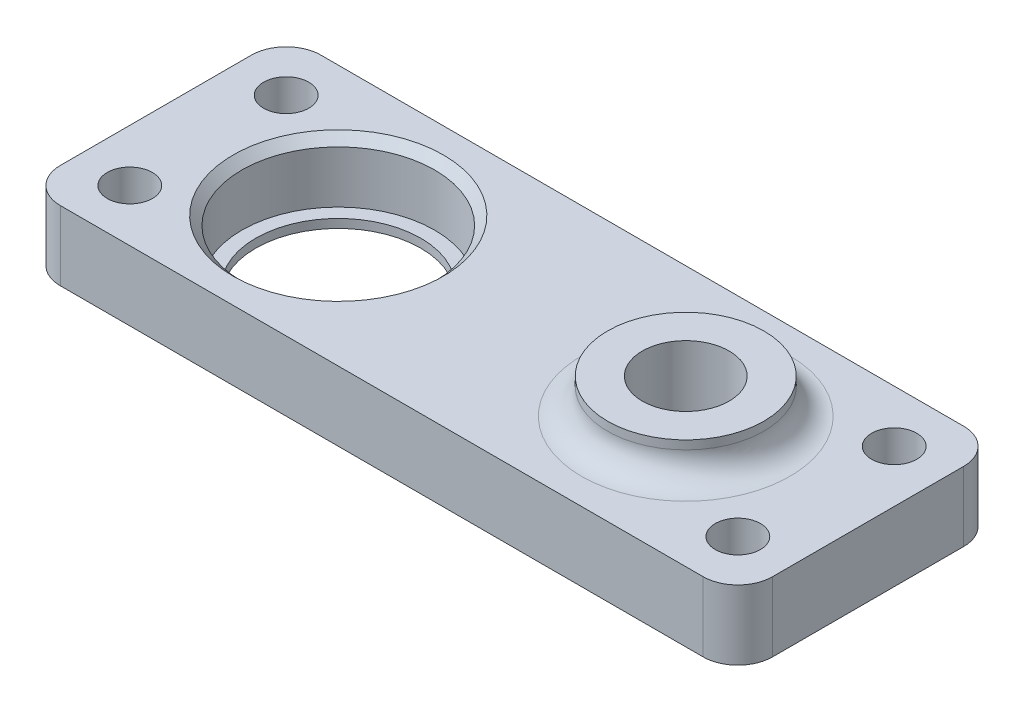
ISO-10303-21;
HEADER;
FILE_DESCRIPTION(('STEP AP214'),'2;1');
FILE_NAME('part.step','',(''),(''),'','','');
FILE_SCHEMA(('AUTOMOTIVE_DESIGN { 1 0 10303 214 1 1 1 1 }'));
ENDSEC;
DATA;
#1=APPLICATION_CONTEXT('core data for automotive mechanical design processes');
#2=APPLICATION_PROTOCOL_DEFINITION('international standard','automotive_design',2000,#1);
#3=PRODUCT_CONTEXT('',#1,'mechanical');
#4=PRODUCT('Part','Part','',(#3));
#5=PRODUCT_RELATED_PRODUCT_CATEGORY('part','',(#4));
#6=PRODUCT_DEFINITION_FORMATION('','',#4);
#7=PRODUCT_DEFINITION_CONTEXT('part definition',#1,'design');
#8=PRODUCT_DEFINITION('design','',#6,#7);
#9=PRODUCT_DEFINITION_SHAPE('','',#8);
#10=(LENGTH_UNIT() NAMED_UNIT(*) SI_UNIT(.MILLI.,.METRE.));
#11=(NAMED_UNIT(*) PLANE_ANGLE_UNIT() SI_UNIT($,.RADIAN.));
#12=(NAMED_UNIT(*) SI_UNIT($,.STERADIAN.) SOLID_ANGLE_UNIT());
#13=UNCERTAINTY_MEASURE_WITH_UNIT(LENGTH_MEASURE(1.E-05),#10,'distance_accuracy_value','');
#14=(GEOMETRIC_REPRESENTATION_CONTEXT(3) GLOBAL_UNCERTAINTY_ASSIGNED_CONTEXT((#13)) GLOBAL_UNIT_ASSIGNED_CONTEXT((#10,
#11,#12)) REPRESENTATION_CONTEXT('',''));
#15=CARTESIAN_POINT('',(0.,0.,0.));
#16=DIRECTION('',(0.,0.,1.));
#17=DIRECTION('',(1.,0.,0.));
#18=AXIS2_PLACEMENT_3D('',#15,#16,#17);
#19=CARTESIAN_POINT('',(57.,8.,-11.));
#20=DIRECTION('',(0.,-1.,0.));
#21=DIRECTION('',(0.,0.,-1.));
#22=AXIS2_PLACEMENT_3D('',#19,#20,#21);
#23=PLANE('',#22);
#24=CARTESIAN_POINT('',(0.,8.,0.));
#25=DIRECTION('',(0.,-1.,0.));
#26=DIRECTION('',(0.,0.,-1.));
#27=AXIS2_PLACEMENT_3D('',#24,#25,#26);
#28=CIRCLE('',#27,12.1);
#29=CARTESIAN_POINT('',(0.,8.,-12.1));
#30=VERTEX_POINT('',#29);
#31=EDGE_CURVE('E11',#30,#30,#28,.T.);
#32=ORIENTED_EDGE('',*,*,#31,.T.);
#33=EDGE_LOOP('',(#32));
#34=FACE_BOUND('',#33,.T.);
#35=CARTESIAN_POINT('',(40.,8.,0.));
#36=DIRECTION('',(0.,-1.,0.));
#37=DIRECTION('',(0.,0.,-1.));
#38=AXIS2_PLACEMENT_3D('',#35,#36,#37);
#39=CIRCLE('',#38,12.);
#40=CARTESIAN_POINT('',(40.,8.,-12.));
#41=VERTEX_POINT('',#40);
#42=EDGE_CURVE('E168',#41,#41,#39,.T.);
#43=ORIENTED_EDGE('',*,*,#42,.T.);
#44=EDGE_LOOP('',(#43));
#45=FACE_BOUND('',#44,.T.);
#46=CARTESIAN_POINT('',(55.,8.,9.));
#47=DIRECTION('',(0.,1.,0.));
#48=DIRECTION('',(0.,0.,1.));
#49=AXIS2_PLACEMENT_3D('',#46,#47,#48);
#50=CIRCLE('',#49,2.6);
#51=CARTESIAN_POINT('',(55.,8.,11.6));
#52=VERTEX_POINT('',#51);
#53=EDGE_CURVE('E267',#52,#52,#50,.T.);
#54=ORIENTED_EDGE('',*,*,#53,.F.);
#55=EDGE_LOOP('',(#54));
#56=FACE_BOUND('',#55,.T.);
#57=CARTESIAN_POINT('',(-15.,8.,9.));
#58=DIRECTION('',(0.,1.,0.));
#59=DIRECTION('',(0.,0.,1.));
#60=AXIS2_PLACEMENT_3D('',#57,#58,#59);
#61=CIRCLE('',#60,2.6);
#62=CARTESIAN_POINT('',(-15.,8.,11.6));
#63=VERTEX_POINT('',#62);
#64=EDGE_CURVE('E255',#63,#63,#61,.T.);
#65=ORIENTED_EDGE('',*,*,#64,.F.);
#66=EDGE_LOOP('',(#65));
#67=FACE_BOUND('',#66,.T.);
#68=CARTESIAN_POINT('',(57.,8.,-11.));
#69=DIRECTION('',(0.,1.,0.));
#70=DIRECTION('',(0.,0.,-1.));
#71=AXIS2_PLACEMENT_3D('',#68,#69,#70);
#72=CIRCLE('',#71,4.00000000000001);
#73=CARTESIAN_POINT('',(61.,8.,-11.));
#74=VERTEX_POINT('',#73);
#75=CARTESIAN_POINT('',(57.,8.,-15.));
#76=VERTEX_POINT('',#75);
#77=EDGE_CURVE('E145',#74,#76,#72,.T.);
#78=ORIENTED_EDGE('',*,*,#77,.T.);
#79=DIRECTION('',(-1.,0.,0.));
#80=VECTOR('',#79,1.);
#81=CARTESIAN_POINT('',(-17.,8.,-15.));
#82=LINE('',#81,#80);
#83=CARTESIAN_POINT('',(-17.,8.,-15.));
#84=VERTEX_POINT('',#83);
#85=EDGE_CURVE('E93',#76,#84,#82,.T.);
#86=ORIENTED_EDGE('',*,*,#85,.T.);
#87=CARTESIAN_POINT('',(-17.,8.,-11.));
#88=DIRECTION('',(0.,1.,0.));
#89=DIRECTION('',(0.,0.,1.));
#90=AXIS2_PLACEMENT_3D('',#87,#88,#89);
#91=CIRCLE('',#90,4.);
#92=CARTESIAN_POINT('',(-21.,8.,-11.));
#93=VERTEX_POINT('',#92);
#94=EDGE_CURVE('E238',#84,#93,#91,.T.);
#95=ORIENTED_EDGE('',*,*,#94,.T.);
#96=DIRECTION('',(0.,0.,1.));
#97=VECTOR('',#96,1.);
#98=CARTESIAN_POINT('',(-21.,8.,-11.));
#99=LINE('',#98,#97);
#100=CARTESIAN_POINT('',(-21.,8.,11.));
#101=VERTEX_POINT('',#100);
#102=EDGE_CURVE('E240',#93,#101,#99,.T.);
#103=ORIENTED_EDGE('',*,*,#102,.T.);
#104=CARTESIAN_POINT('',(-17.,8.,11.));
#105=DIRECTION('',(0.,1.,0.));
#106=DIRECTION('',(0.,0.,-1.));
#107=AXIS2_PLACEMENT_3D('',#104,#105,#106);
#108=CIRCLE('',#107,4.);
#109=CARTESIAN_POINT('',(-17.,8.,15.));
#110=VERTEX_POINT('',#109);
#111=EDGE_CURVE('E112',#101,#110,#108,.T.);
#112=ORIENTED_EDGE('',*,*,#111,.T.);
#113=DIRECTION('',(1.,0.,0.));
#114=VECTOR('',#113,1.);
#115=CARTESIAN_POINT('',(-17.,8.,15.));
#116=LINE('',#115,#114);
#117=CARTESIAN_POINT('',(57.,8.,15.));
#118=VERTEX_POINT('',#117);
#119=EDGE_CURVE('E106',#110,#118,#116,.T.);
#120=ORIENTED_EDGE('',*,*,#119,.T.);
#121=CARTESIAN_POINT('',(57.,8.,11.));
#122=DIRECTION('',(0.,1.,0.));
#123=DIRECTION('',(0.,0.,1.));
#124=AXIS2_PLACEMENT_3D('',#121,#122,#123);
#125=CIRCLE('',#124,4.00000000000001);
#126=CARTESIAN_POINT('',(61.,8.,11.));
#127=VERTEX_POINT('',#126);
#128=EDGE_CURVE('E110',#118,#127,#125,.T.);
#129=ORIENTED_EDGE('',*,*,#128,.T.);
#130=DIRECTION('',(0.,0.,-1.));
#131=VECTOR('',#130,1.);
#132=CARTESIAN_POINT('',(61.,8.,-11.));
#133=LINE('',#132,#131);
#134=EDGE_CURVE('E49',#127,#74,#133,.T.);
#135=ORIENTED_EDGE('',*,*,#134,.T.);
#136=EDGE_LOOP('',(#78,#86,#95,#103,#112,#120,#129,#135));
#137=FACE_BOUND('',#136,.T.);
#138=CARTESIAN_POINT('',(-15.,8.,-9.));
#139=DIRECTION('',(0.,1.,0.));
#140=DIRECTION('',(0.,0.,1.));
#141=AXIS2_PLACEMENT_3D('',#138,#139,#140);
#142=CIRCLE('',#141,2.6);
#143=CARTESIAN_POINT('',(-15.,8.,-6.4));
#144=VERTEX_POINT('',#143);
#145=EDGE_CURVE('E251',#144,#144,#142,.T.);
#146=ORIENTED_EDGE('',*,*,#145,.F.);
#147=EDGE_LOOP('',(#146));
#148=FACE_BOUND('',#147,.T.);
#149=CARTESIAN_POINT('',(55.,8.,-9.));
#150=DIRECTION('',(0.,1.,0.));
#151=DIRECTION('',(0.,0.,1.));
#152=AXIS2_PLACEMENT_3D('',#149,#150,#151);
#153=CIRCLE('',#152,2.6);
#154=CARTESIAN_POINT('',(55.,8.,-6.4));
#155=VERTEX_POINT('',#154);
#156=EDGE_CURVE('E261',#155,#155,#153,.T.);
#157=ORIENTED_EDGE('',*,*,#156,.F.);
#158=EDGE_LOOP('',(#157));
#159=FACE_BOUND('',#158,.T.);
#160=ADVANCED_FACE('F32',(#34,#45,#56,#67,#137,#148,#159),#23,.F.);
#161=CARTESIAN_POINT('',(0.,8.,0.));
#162=DIRECTION('',(0.,-1.,0.));
#163=DIRECTION('',(0.,0.,-1.));
#164=AXIS2_PLACEMENT_3D('',#161,#162,#163);
#165=CYLINDRICAL_SURFACE('',#164,9.5);
#166=CARTESIAN_POINT('',(0.,0.,0.));
#167=DIRECTION('',(0.,1.,0.));
#168=DIRECTION('',(0.,0.,1.));
#169=AXIS2_PLACEMENT_3D('',#166,#167,#168);
#170=CIRCLE('',#169,9.5);
#171=CARTESIAN_POINT('',(0.,0.,9.5));
#172=VERTEX_POINT('',#171);
#173=EDGE_CURVE('E134',#172,#172,#170,.T.);
#174=ORIENTED_EDGE('',*,*,#173,.F.);
#175=EDGE_LOOP('',(#174));
#176=FACE_BOUND('',#175,.T.);
#177=CARTESIAN_POINT('',(0.,1.,0.));
#178=DIRECTION('',(0.,1.,0.));
#179=DIRECTION('',(0.,0.,1.));
#180=AXIS2_PLACEMENT_3D('',#177,#178,#179);
#181=CIRCLE('',#180,9.5);
#182=CARTESIAN_POINT('',(0.,1.,9.5));
#183=VERTEX_POINT('',#182);
#184=EDGE_CURVE('E161',#183,#183,#181,.T.);
#185=ORIENTED_EDGE('',*,*,#184,.T.);
#186=EDGE_LOOP('',(#185));
#187=FACE_BOUND('',#186,.T.);
#188=ADVANCED_FACE('F186',(#176,#187),#165,.F.);
#189=CARTESIAN_POINT('',(57.,0.,-11.));
#190=DIRECTION('',(0.,-1.,0.));
#191=DIRECTION('',(0.,0.,-1.));
#192=AXIS2_PLACEMENT_3D('',#189,#190,#191);
#193=PLANE('',#192);
#194=CARTESIAN_POINT('',(55.,0.,-9.));
#195=DIRECTION('',(0.,1.,0.));
#196=DIRECTION('',(0.,0.,1.));
#197=AXIS2_PLACEMENT_3D('',#194,#195,#196);
#198=CIRCLE('',#197,2.6);
#199=CARTESIAN_POINT('',(55.,0.,-6.4));
#200=VERTEX_POINT('',#199);
#201=EDGE_CURVE('E264',#200,#200,#198,.T.);
#202=ORIENTED_EDGE('',*,*,#201,.T.);
#203=EDGE_LOOP('',(#202));
#204=FACE_BOUND('',#203,.T.);
#205=CARTESIAN_POINT('',(-15.,0.,-9.));
#206=DIRECTION('',(0.,1.,0.));
#207=DIRECTION('',(0.,0.,1.));
#208=AXIS2_PLACEMENT_3D('',#205,#206,#207);
#209=CIRCLE('',#208,2.6);
#210=CARTESIAN_POINT('',(-15.,0.,-6.4));
#211=VERTEX_POINT('',#210);
#212=EDGE_CURVE('E252',#211,#211,#209,.T.);
#213=ORIENTED_EDGE('',*,*,#212,.T.);
#214=EDGE_LOOP('',(#213));
#215=FACE_BOUND('',#214,.T.);
#216=ORIENTED_EDGE('',*,*,#173,.T.);
#217=EDGE_LOOP('',(#216));
#218=FACE_BOUND('',#217,.T.);
#219=CARTESIAN_POINT('',(57.,0.,-11.));
#220=DIRECTION('',(0.,1.,0.));
#221=DIRECTION('',(0.,0.,-1.));
#222=AXIS2_PLACEMENT_3D('',#219,#220,#221);
#223=CIRCLE('',#222,4.00000000000001);
#224=CARTESIAN_POINT('',(61.,0.,-11.));
#225=VERTEX_POINT('',#224);
#226=CARTESIAN_POINT('',(57.,0.,-15.));
#227=VERTEX_POINT('',#226);
#228=EDGE_CURVE('E130',#225,#227,#223,.T.);
#229=ORIENTED_EDGE('',*,*,#228,.F.);
#230=DIRECTION('',(0.,0.,-1.));
#231=VECTOR('',#230,1.);
#232=CARTESIAN_POINT('',(61.,0.,-11.));
#233=LINE('',#232,#231);
#234=CARTESIAN_POINT('',(61.,0.,11.));
#235=VERTEX_POINT('',#234);
#236=EDGE_CURVE('E84',#235,#225,#233,.T.);
#237=ORIENTED_EDGE('',*,*,#236,.F.);
#238=CARTESIAN_POINT('',(57.,0.,11.));
#239=DIRECTION('',(0.,1.,0.));
#240=DIRECTION('',(0.,0.,1.));
#241=AXIS2_PLACEMENT_3D('',#238,#239,#240);
#242=CIRCLE('',#241,4.00000000000001);
#243=CARTESIAN_POINT('',(57.,0.,15.));
#244=VERTEX_POINT('',#243);
#245=EDGE_CURVE('E78',#244,#235,#242,.T.);
#246=ORIENTED_EDGE('',*,*,#245,.F.);
#247=DIRECTION('',(1.,0.,0.));
#248=VECTOR('',#247,1.);
#249=CARTESIAN_POINT('',(-17.,0.,15.));
#250=LINE('',#249,#248);
#251=CARTESIAN_POINT('',(-17.,0.,15.));
#252=VERTEX_POINT('',#251);
#253=EDGE_CURVE('E120',#252,#244,#250,.T.);
#254=ORIENTED_EDGE('',*,*,#253,.F.);
#255=CARTESIAN_POINT('',(-17.,0.,11.));
#256=DIRECTION('',(0.,1.,0.));
#257=DIRECTION('',(0.,0.,-1.));
#258=AXIS2_PLACEMENT_3D('',#255,#256,#257);
#259=CIRCLE('',#258,4.);
#260=CARTESIAN_POINT('',(-21.,0.,11.));
#261=VERTEX_POINT('',#260);
#262=EDGE_CURVE('E140',#261,#252,#259,.T.);
#263=ORIENTED_EDGE('',*,*,#262,.F.);
#264=DIRECTION('',(0.,0.,1.));
#265=VECTOR('',#264,1.);
#266=CARTESIAN_POINT('',(-21.,0.,-11.));
#267=LINE('',#266,#265);
#268=CARTESIAN_POINT('',(-21.,0.,-11.));
#269=VERTEX_POINT('',#268);
#270=EDGE_CURVE('E138',#269,#261,#267,.T.);
#271=ORIENTED_EDGE('',*,*,#270,.F.);
#272=CARTESIAN_POINT('',(-17.,0.,-11.));
#273=DIRECTION('',(0.,1.,0.));
#274=DIRECTION('',(0.,0.,1.));
#275=AXIS2_PLACEMENT_3D('',#272,#273,#274);
#276=CIRCLE('',#275,4.);
#277=CARTESIAN_POINT('',(-17.,0.,-15.));
#278=VERTEX_POINT('',#277);
#279=EDGE_CURVE('E136',#278,#269,#276,.T.);
#280=ORIENTED_EDGE('',*,*,#279,.F.);
#281=DIRECTION('',(-1.,0.,0.));
#282=VECTOR('',#281,1.);
#283=CARTESIAN_POINT('',(-17.,0.,-15.));
#284=LINE('',#283,#282);
#285=EDGE_CURVE('E133',#227,#278,#284,.T.);
#286=ORIENTED_EDGE('',*,*,#285,.F.);
#287=EDGE_LOOP('',(#229,#237,#246,#254,#263,#271,#280,#286));
#288=FACE_BOUND('',#287,.T.);
#289=CARTESIAN_POINT('',(40.,0.,0.));
#290=DIRECTION('',(0.,1.,0.));
#291=DIRECTION('',(0.,0.,1.));
#292=AXIS2_PLACEMENT_3D('',#289,#290,#291);
#293=CIRCLE('',#292,5.);
#294=CARTESIAN_POINT('',(40.,0.,5.));
#295=VERTEX_POINT('',#294);
#296=EDGE_CURVE('E248',#295,#295,#293,.T.);
#297=ORIENTED_EDGE('',*,*,#296,.T.);
#298=EDGE_LOOP('',(#297));
#299=FACE_BOUND('',#298,.T.);
#300=CARTESIAN_POINT('',(-15.,0.,9.));
#301=DIRECTION('',(0.,1.,0.));
#302=DIRECTION('',(0.,0.,1.));
#303=AXIS2_PLACEMENT_3D('',#300,#301,#302);
#304=CIRCLE('',#303,2.6);
#305=CARTESIAN_POINT('',(-15.,0.,11.6));
#306=VERTEX_POINT('',#305);
#307=EDGE_CURVE('E258',#306,#306,#304,.T.);
#308=ORIENTED_EDGE('',*,*,#307,.T.);
#309=EDGE_LOOP('',(#308));
#310=FACE_BOUND('',#309,.T.);
#311=CARTESIAN_POINT('',(55.,0.,9.));
#312=DIRECTION('',(0.,1.,0.));
#313=DIRECTION('',(0.,0.,1.));
#314=AXIS2_PLACEMENT_3D('',#311,#312,#313);
#315=CIRCLE('',#314,2.6);
#316=CARTESIAN_POINT('',(55.,0.,11.6));
#317=VERTEX_POINT('',#316);
#318=EDGE_CURVE('E164',#317,#317,#315,.T.);
#319=ORIENTED_EDGE('',*,*,#318,.T.);
#320=EDGE_LOOP('',(#319));
#321=FACE_BOUND('',#320,.T.);
#322=ADVANCED_FACE('F192',(#204,#215,#218,#288,#299,#310,#321),#193,.T.);
#323=CARTESIAN_POINT('',(57.,8.,-11.));
#324=DIRECTION('',(0.,-1.,0.));
#325=DIRECTION('',(0.,0.,-1.));
#326=AXIS2_PLACEMENT_3D('',#323,#324,#325);
#327=CYLINDRICAL_SURFACE('',#326,4.00000000000001);
#328=ORIENTED_EDGE('',*,*,#228,.T.);
#329=DIRECTION('',(0.,-1.,0.));
#330=VECTOR('',#329,1.);
#331=CARTESIAN_POINT('',(57.,8.,-15.));
#332=LINE('',#331,#330);
#333=EDGE_CURVE('E158',#76,#227,#332,.T.);
#334=ORIENTED_EDGE('',*,*,#333,.F.);
#335=ORIENTED_EDGE('',*,*,#77,.F.);
#336=DIRECTION('',(0.,-1.,0.));
#337=VECTOR('',#336,1.);
#338=CARTESIAN_POINT('',(61.,8.,-11.));
#339=LINE('',#338,#337);
#340=EDGE_CURVE('E126',#74,#225,#339,.T.);
#341=ORIENTED_EDGE('',*,*,#340,.T.);
#342=EDGE_LOOP('',(#328,#334,#335,#341));
#343=FACE_BOUND('',#342,.T.);
#344=ADVANCED_FACE('F200',(#343),#327,.T.);
#345=CARTESIAN_POINT('',(-17.,8.,-15.));
#346=DIRECTION('',(0.,0.,1.));
#347=DIRECTION('',(1.,0.,0.));
#348=AXIS2_PLACEMENT_3D('',#345,#346,#347);
#349=PLANE('',#348);
#350=ORIENTED_EDGE('',*,*,#285,.T.);
#351=DIRECTION('',(0.,-1.,0.));
#352=VECTOR('',#351,1.);
#353=CARTESIAN_POINT('',(-17.,8.,-15.));
#354=LINE('',#353,#352);
#355=EDGE_CURVE('E155',#84,#278,#354,.T.);
#356=ORIENTED_EDGE('',*,*,#355,.F.);
#357=ORIENTED_EDGE('',*,*,#85,.F.);
#358=ORIENTED_EDGE('',*,*,#333,.T.);
#359=EDGE_LOOP('',(#350,#356,#357,#358));
#360=FACE_BOUND('',#359,.T.);
#361=ADVANCED_FACE('F221',(#360),#349,.F.);
#362=CARTESIAN_POINT('',(-17.,8.,-11.));
#363=DIRECTION('',(0.,-1.,0.));
#364=DIRECTION('',(0.,0.,-1.));
#365=AXIS2_PLACEMENT_3D('',#362,#363,#364);
#366=CYLINDRICAL_SURFACE('',#365,4.);
#367=ORIENTED_EDGE('',*,*,#279,.T.);
#368=DIRECTION('',(0.,-1.,0.));
#369=VECTOR('',#368,1.);
#370=CARTESIAN_POINT('',(-21.,8.,-11.));
#371=LINE('',#370,#369);
#372=EDGE_CURVE('E152',#93,#269,#371,.T.);
#373=ORIENTED_EDGE('',*,*,#372,.F.);
#374=ORIENTED_EDGE('',*,*,#94,.F.);
#375=ORIENTED_EDGE('',*,*,#355,.T.);
#376=EDGE_LOOP('',(#367,#373,#374,#375));
#377=FACE_BOUND('',#376,.T.);
#378=ADVANCED_FACE('F217',(#377),#366,.T.);
#379=CARTESIAN_POINT('',(-21.,8.,-11.));
#380=DIRECTION('',(1.,0.,0.));
#381=DIRECTION('',(0.,0.,-1.));
#382=AXIS2_PLACEMENT_3D('',#379,#380,#381);
#383=PLANE('',#382);
#384=ORIENTED_EDGE('',*,*,#270,.T.);
#385=DIRECTION('',(0.,-1.,0.));
#386=VECTOR('',#385,1.);
#387=CARTESIAN_POINT('',(-21.,8.,11.));
#388=LINE('',#387,#386);
#389=EDGE_CURVE('E149',#101,#261,#388,.T.);
#390=ORIENTED_EDGE('',*,*,#389,.F.);
#391=ORIENTED_EDGE('',*,*,#102,.F.);
#392=ORIENTED_EDGE('',*,*,#372,.T.);
#393=EDGE_LOOP('',(#384,#390,#391,#392));
#394=FACE_BOUND('',#393,.T.);
#395=ADVANCED_FACE('F213',(#394),#383,.F.);
#396=CARTESIAN_POINT('',(-17.,8.,11.));
#397=DIRECTION('',(0.,-1.,0.));
#398=DIRECTION('',(0.,0.,-1.));
#399=AXIS2_PLACEMENT_3D('',#396,#397,#398);
#400=CYLINDRICAL_SURFACE('',#399,4.);
#401=ORIENTED_EDGE('',*,*,#262,.T.);
#402=DIRECTION('',(0.,-1.,0.));
#403=VECTOR('',#402,1.);
#404=CARTESIAN_POINT('',(-17.,8.,15.));
#405=LINE('',#404,#403);
#406=EDGE_CURVE('E121',#110,#252,#405,.T.);
#407=ORIENTED_EDGE('',*,*,#406,.F.);
#408=ORIENTED_EDGE('',*,*,#111,.F.);
#409=ORIENTED_EDGE('',*,*,#389,.T.);
#410=EDGE_LOOP('',(#401,#407,#408,#409));
#411=FACE_BOUND('',#410,.T.);
#412=ADVANCED_FACE('F210',(#411),#400,.T.);
#413=CARTESIAN_POINT('',(-17.,8.,15.));
#414=DIRECTION('',(0.,0.,-1.));
#415=DIRECTION('',(-1.,0.,0.));
#416=AXIS2_PLACEMENT_3D('',#413,#414,#415);
#417=PLANE('',#416);
#418=ORIENTED_EDGE('',*,*,#253,.T.);
#419=DIRECTION('',(0.,-1.,0.));
#420=VECTOR('',#419,1.);
#421=CARTESIAN_POINT('',(57.,8.,15.));
#422=LINE('',#421,#420);
#423=EDGE_CURVE('E117',#118,#244,#422,.T.);
#424=ORIENTED_EDGE('',*,*,#423,.F.);
#425=ORIENTED_EDGE('',*,*,#119,.F.);
#426=ORIENTED_EDGE('',*,*,#406,.T.);
#427=EDGE_LOOP('',(#418,#424,#425,#426));
#428=FACE_BOUND('',#427,.T.);
#429=ADVANCED_FACE('F118',(#428),#417,.F.);
#430=CARTESIAN_POINT('',(57.,8.,11.));
#431=DIRECTION('',(0.,-1.,0.));
#432=DIRECTION('',(0.,0.,-1.));
#433=AXIS2_PLACEMENT_3D('',#430,#431,#432);
#434=CYLINDRICAL_SURFACE('',#433,4.00000000000001);
#435=ORIENTED_EDGE('',*,*,#245,.T.);
#436=DIRECTION('',(0.,-1.,0.));
#437=VECTOR('',#436,1.);
#438=CARTESIAN_POINT('',(61.,8.,11.));
#439=LINE('',#438,#437);
#440=EDGE_CURVE('E122',#127,#235,#439,.T.);
#441=ORIENTED_EDGE('',*,*,#440,.F.);
#442=ORIENTED_EDGE('',*,*,#128,.F.);
#443=ORIENTED_EDGE('',*,*,#423,.T.);
#444=EDGE_LOOP('',(#435,#441,#442,#443));
#445=FACE_BOUND('',#444,.T.);
#446=ADVANCED_FACE('F124',(#445),#434,.T.);
#447=CARTESIAN_POINT('',(61.,8.,-11.));
#448=DIRECTION('',(-1.,0.,0.));
#449=DIRECTION('',(0.,0.,1.));
#450=AXIS2_PLACEMENT_3D('',#447,#448,#449);
#451=PLANE('',#450);
#452=ORIENTED_EDGE('',*,*,#236,.T.);
#453=ORIENTED_EDGE('',*,*,#340,.F.);
#454=ORIENTED_EDGE('',*,*,#134,.F.);
#455=ORIENTED_EDGE('',*,*,#440,.T.);
#456=EDGE_LOOP('',(#452,#453,#454,#455));
#457=FACE_BOUND('',#456,.T.);
#458=ADVANCED_FACE('F202',(#457),#451,.F.);
#459=CARTESIAN_POINT('',(40.,8.,0.));
#460=DIRECTION('',(0.,-1.,0.));
#461=DIRECTION('',(0.,0.,-1.));
#462=AXIS2_PLACEMENT_3D('',#459,#460,#461);
#463=CYLINDRICAL_SURFACE('',#462,5.);
#464=ORIENTED_EDGE('',*,*,#296,.F.);
#465=EDGE_LOOP('',(#464));
#466=FACE_BOUND('',#465,.T.);
#467=CARTESIAN_POINT('',(40.,12.,0.));
#468=DIRECTION('',(0.,1.,0.));
#469=DIRECTION('',(0.,0.,1.));
#470=AXIS2_PLACEMENT_3D('',#467,#468,#469);
#471=CIRCLE('',#470,5.);
#472=CARTESIAN_POINT('',(40.,12.,5.));
#473=VERTEX_POINT('',#472);
#474=EDGE_CURVE('E279',#473,#473,#471,.T.);
#475=ORIENTED_EDGE('',*,*,#474,.T.);
#476=EDGE_LOOP('',(#475));
#477=FACE_BOUND('',#476,.T.);
#478=ADVANCED_FACE('F205',(#466,#477),#463,.F.);
#479=CARTESIAN_POINT('',(-15.,8.,-9.));
#480=DIRECTION('',(0.,-1.,0.));
#481=DIRECTION('',(0.,0.,-1.));
#482=AXIS2_PLACEMENT_3D('',#479,#480,#481);
#483=CYLINDRICAL_SURFACE('',#482,2.6);
#484=ORIENTED_EDGE('',*,*,#145,.T.);
#485=EDGE_LOOP('',(#484));
#486=FACE_BOUND('',#485,.T.);
#487=ORIENTED_EDGE('',*,*,#212,.F.);
#488=EDGE_LOOP('',(#487));
#489=FACE_BOUND('',#488,.T.);
#490=ADVANCED_FACE('F311',(#486,#489),#483,.F.);
#491=CARTESIAN_POINT('',(-15.,8.,9.));
#492=DIRECTION('',(0.,-1.,0.));
#493=DIRECTION('',(0.,0.,-1.));
#494=AXIS2_PLACEMENT_3D('',#491,#492,#493);
#495=CYLINDRICAL_SURFACE('',#494,2.6);
#496=ORIENTED_EDGE('',*,*,#64,.T.);
#497=EDGE_LOOP('',(#496));
#498=FACE_BOUND('',#497,.T.);
#499=ORIENTED_EDGE('',*,*,#307,.F.);
#500=EDGE_LOOP('',(#499));
#501=FACE_BOUND('',#500,.T.);
#502=ADVANCED_FACE('F307',(#498,#501),#495,.F.);
#503=CARTESIAN_POINT('',(55.,8.,-9.));
#504=DIRECTION('',(0.,-1.,0.));
#505=DIRECTION('',(0.,0.,-1.));
#506=AXIS2_PLACEMENT_3D('',#503,#504,#505);
#507=CYLINDRICAL_SURFACE('',#506,2.6);
#508=ORIENTED_EDGE('',*,*,#156,.T.);
#509=EDGE_LOOP('',(#508));
#510=FACE_BOUND('',#509,.T.);
#511=ORIENTED_EDGE('',*,*,#201,.F.);
#512=EDGE_LOOP('',(#511));
#513=FACE_BOUND('',#512,.T.);
#514=ADVANCED_FACE('F303',(#510,#513),#507,.F.);
#515=CARTESIAN_POINT('',(55.,8.,9.));
#516=DIRECTION('',(0.,-1.,0.));
#517=DIRECTION('',(0.,0.,-1.));
#518=AXIS2_PLACEMENT_3D('',#515,#516,#517);
#519=CYLINDRICAL_SURFACE('',#518,2.6);
#520=ORIENTED_EDGE('',*,*,#53,.T.);
#521=EDGE_LOOP('',(#520));
#522=FACE_BOUND('',#521,.T.);
#523=ORIENTED_EDGE('',*,*,#318,.F.);
#524=EDGE_LOOP('',(#523));
#525=FACE_BOUND('',#524,.T.);
#526=ADVANCED_FACE('F300',(#522,#525),#519,.F.);
#527=CARTESIAN_POINT('',(0.,1.,0.));
#528=DIRECTION('',(0.,1.,0.));
#529=DIRECTION('',(0.,0.,1.));
#530=AXIS2_PLACEMENT_3D('',#527,#528,#529);
#531=CYLINDRICAL_SURFACE('',#530,11.1);
#532=CARTESIAN_POINT('',(0.,6.99999999999998,0.));
#533=DIRECTION('',(0.,-1.,0.));
#534=DIRECTION('',(0.,0.,-1.));
#535=AXIS2_PLACEMENT_3D('',#532,#533,#534);
#536=CIRCLE('',#535,11.1);
#537=CARTESIAN_POINT('',(0.,6.99999999999998,-11.1));
#538=VERTEX_POINT('',#537);
#539=EDGE_CURVE('E41',#538,#538,#536,.F.);
#540=ORIENTED_EDGE('',*,*,#539,.T.);
#541=EDGE_LOOP('',(#540));
#542=FACE_BOUND('',#541,.T.);
#543=CARTESIAN_POINT('',(0.,1.,0.));
#544=DIRECTION('',(0.,1.,0.));
#545=DIRECTION('',(0.,0.,1.));
#546=AXIS2_PLACEMENT_3D('',#543,#544,#545);
#547=CIRCLE('',#546,11.1);
#548=CARTESIAN_POINT('',(0.,1.,11.1));
#549=VERTEX_POINT('',#548);
#550=EDGE_CURVE('E165',#549,#549,#547,.T.);
#551=ORIENTED_EDGE('',*,*,#550,.F.);
#552=EDGE_LOOP('',(#551));
#553=FACE_BOUND('',#552,.T.);
#554=ADVANCED_FACE('F173',(#542,#553),#531,.F.);
#555=CARTESIAN_POINT('',(0.,1.,0.));
#556=DIRECTION('',(0.,1.,0.));
#557=DIRECTION('',(0.,0.,1.));
#558=AXIS2_PLACEMENT_3D('',#555,#556,#557);
#559=PLANE('',#558);
#560=ORIENTED_EDGE('',*,*,#184,.F.);
#561=EDGE_LOOP('',(#560));
#562=FACE_BOUND('',#561,.T.);
#563=ORIENTED_EDGE('',*,*,#550,.T.);
#564=EDGE_LOOP('',(#563));
#565=FACE_BOUND('',#564,.T.);
#566=ADVANCED_FACE('F286',(#562,#565),#559,.T.);
#567=CARTESIAN_POINT('',(40.,12.,0.));
#568=DIRECTION('',(0.,1.,0.));
#569=DIRECTION('',(0.,0.,1.));
#570=AXIS2_PLACEMENT_3D('',#567,#568,#569);
#571=PLANE('',#570);
#572=CARTESIAN_POINT('',(40.,12.,0.));
#573=DIRECTION('',(0.,1.,0.));
#574=DIRECTION('',(0.,0.,1.));
#575=AXIS2_PLACEMENT_3D('',#572,#573,#574);
#576=CIRCLE('',#575,9.);
#577=CARTESIAN_POINT('',(40.,12.,9.));
#578=VERTEX_POINT('',#577);
#579=EDGE_CURVE('E276',#578,#578,#576,.T.);
#580=ORIENTED_EDGE('',*,*,#579,.T.);
#581=EDGE_LOOP('',(#580));
#582=FACE_BOUND('',#581,.T.);
#583=ORIENTED_EDGE('',*,*,#474,.F.);
#584=EDGE_LOOP('',(#583));
#585=FACE_BOUND('',#584,.T.);
#586=ADVANCED_FACE('F284',(#582,#585),#571,.T.);
#587=CARTESIAN_POINT('',(40.,12.,0.));
#588=DIRECTION('',(0.,-1.,0.));
#589=DIRECTION('',(0.,0.,-1.));
#590=AXIS2_PLACEMENT_3D('',#587,#588,#589);
#591=CYLINDRICAL_SURFACE('',#590,9.);
#592=CARTESIAN_POINT('',(40.,11.,0.));
#593=DIRECTION('',(0.,-1.,0.));
#594=DIRECTION('',(0.,0.,-1.));
#595=AXIS2_PLACEMENT_3D('',#592,#593,#594);
#596=CIRCLE('',#595,9.);
#597=CARTESIAN_POINT('',(40.,11.,-9.));
#598=VERTEX_POINT('',#597);
#599=EDGE_CURVE('E160',#598,#598,#596,.F.);
#600=ORIENTED_EDGE('',*,*,#599,.T.);
#601=EDGE_LOOP('',(#600));
#602=FACE_BOUND('',#601,.T.);
#603=ORIENTED_EDGE('',*,*,#579,.F.);
#604=EDGE_LOOP('',(#603));
#605=FACE_BOUND('',#604,.T.);
#606=ADVANCED_FACE('F182',(#602,#605),#591,.T.);
#607=CARTESIAN_POINT('',(40.,11.,0.));
#608=DIRECTION('',(0.,-1.,0.));
#609=DIRECTION('',(0.,0.,-1.));
#610=AXIS2_PLACEMENT_3D('',#607,#608,#609);
#611=TOROIDAL_SURFACE('',#610,12.,3.);
#612=ORIENTED_EDGE('',*,*,#42,.F.);
#613=EDGE_LOOP('',(#612));
#614=FACE_BOUND('',#613,.T.);
#615=ORIENTED_EDGE('',*,*,#599,.F.);
#616=EDGE_LOOP('',(#615));
#617=FACE_BOUND('',#616,.T.);
#618=ADVANCED_FACE('F177',(#614,#617),#611,.F.);
#619=CARTESIAN_POINT('',(0.,6.99999999999998,0.));
#620=DIRECTION('',(0.,1.,0.));
#621=DIRECTION('',(0.,0.,1.));
#622=AXIS2_PLACEMENT_3D('',#619,#620,#621);
#623=CONICAL_SURFACE('',#622,11.1,0.785398163397447);
#624=ORIENTED_EDGE('',*,*,#31,.F.);
#625=EDGE_LOOP('',(#624));
#626=FACE_BOUND('',#625,.T.);
#627=ORIENTED_EDGE('',*,*,#539,.F.);
#628=EDGE_LOOP('',(#627));
#629=FACE_BOUND('',#628,.T.);
#630=ADVANCED_FACE('F34',(#626,#629),#623,.F.);
#631=CLOSED_SHELL('',(#160,#188,#322,#344,#361,#378,#395,#412,#429,#446,#458,#478,#490,#502,
#514,#526,#554,#566,#586,#606,#618,#630));
#632=MANIFOLD_SOLID_BREP('B2',#631);
#633=ADVANCED_BREP_SHAPE_REPRESENTATION('',(#18,#632),#14);
#634=SHAPE_DEFINITION_REPRESENTATION(#9,#633);
ENDSEC;
END-ISO-10303-21;
